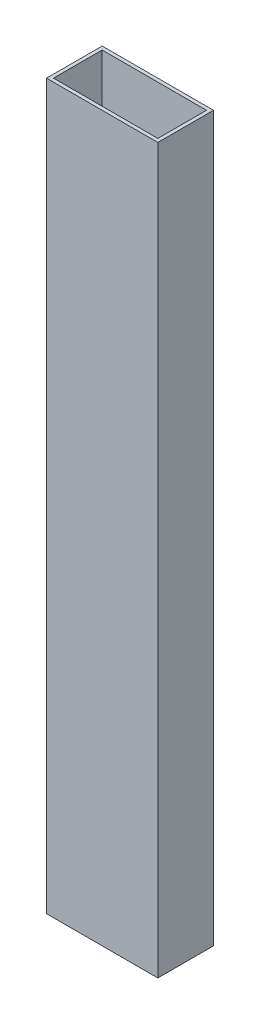
ISO-10303-21;
HEADER;
FILE_DESCRIPTION(('STEP AP214'),'2;1');
FILE_NAME('part.step','',(''),(''),'','','');
FILE_SCHEMA(('AUTOMOTIVE_DESIGN { 1 0 10303 214 1 1 1 1 }'));
ENDSEC;
DATA;
#1=APPLICATION_CONTEXT('core data for automotive mechanical design processes');
#2=APPLICATION_PROTOCOL_DEFINITION('international standard','automotive_design',2000,#1);
#3=PRODUCT_CONTEXT('',#1,'mechanical');
#4=PRODUCT('Part','Part','',(#3));
#5=PRODUCT_RELATED_PRODUCT_CATEGORY('part','',(#4));
#6=PRODUCT_DEFINITION_FORMATION('','',#4);
#7=PRODUCT_DEFINITION_CONTEXT('part definition',#1,'design');
#8=PRODUCT_DEFINITION('design','',#6,#7);
#9=PRODUCT_DEFINITION_SHAPE('','',#8);
#10=(LENGTH_UNIT() NAMED_UNIT(*) SI_UNIT(.MILLI.,.METRE.));
#11=(NAMED_UNIT(*) PLANE_ANGLE_UNIT() SI_UNIT($,.RADIAN.));
#12=(NAMED_UNIT(*) SI_UNIT($,.STERADIAN.) SOLID_ANGLE_UNIT());
#13=UNCERTAINTY_MEASURE_WITH_UNIT(LENGTH_MEASURE(1.E-05),#10,'distance_accuracy_value','');
#14=(GEOMETRIC_REPRESENTATION_CONTEXT(3) GLOBAL_UNCERTAINTY_ASSIGNED_CONTEXT((#13)) GLOBAL_UNIT_ASSIGNED_CONTEXT((#10,
#11,#12)) REPRESENTATION_CONTEXT('',''));
#15=CARTESIAN_POINT('',(0.,0.,0.));
#16=DIRECTION('',(0.,0.,1.));
#17=DIRECTION('',(1.,0.,0.));
#18=AXIS2_PLACEMENT_3D('',#15,#16,#17);
#19=CARTESIAN_POINT('',(0.,330.2,0.));
#20=DIRECTION('',(0.,1.,0.));
#21=DIRECTION('',(0.,0.,1.));
#22=AXIS2_PLACEMENT_3D('',#19,#20,#21);
#23=PLANE('',#22);
#24=DIRECTION('',(0.,0.,1.));
#25=VECTOR('',#24,1.);
#26=CARTESIAN_POINT('',(0.,330.2,0.));
#27=LINE('',#26,#25);
#28=CARTESIAN_POINT('',(0.,330.2,-25.4));
#29=VERTEX_POINT('',#28);
#30=CARTESIAN_POINT('',(0.,330.2,0.));
#31=VERTEX_POINT('',#30);
#32=EDGE_CURVE('E158',#29,#31,#27,.T.);
#33=ORIENTED_EDGE('',*,*,#32,.T.);
#34=DIRECTION('',(1.,0.,0.));
#35=VECTOR('',#34,1.);
#36=CARTESIAN_POINT('',(0.,330.2,0.));
#37=LINE('',#36,#35);
#38=CARTESIAN_POINT('',(50.8,330.2,0.));
#39=VERTEX_POINT('',#38);
#40=EDGE_CURVE('E161',#31,#39,#37,.T.);
#41=ORIENTED_EDGE('',*,*,#40,.T.);
#42=DIRECTION('',(0.,0.,-1.));
#43=VECTOR('',#42,1.);
#44=CARTESIAN_POINT('',(50.8,330.2,0.));
#45=LINE('',#44,#43);
#46=CARTESIAN_POINT('',(50.8,330.2,-25.4));
#47=VERTEX_POINT('',#46);
#48=EDGE_CURVE('E164',#39,#47,#45,.T.);
#49=ORIENTED_EDGE('',*,*,#48,.T.);
#50=DIRECTION('',(-1.,0.,0.));
#51=VECTOR('',#50,1.);
#52=CARTESIAN_POINT('',(0.,330.2,-25.4));
#53=LINE('',#52,#51);
#54=EDGE_CURVE('E166',#47,#29,#53,.T.);
#55=ORIENTED_EDGE('',*,*,#54,.T.);
#56=EDGE_LOOP('',(#33,#41,#49,#55));
#57=FACE_BOUND('',#56,.T.);
#58=DIRECTION('',(1.,0.,0.));
#59=VECTOR('',#58,1.);
#60=CARTESIAN_POINT('',(0.,330.2,-1.5875));
#61=LINE('',#60,#59);
#62=CARTESIAN_POINT('',(1.5875,330.2,-1.5875));
#63=VERTEX_POINT('',#62);
#64=CARTESIAN_POINT('',(49.2125,330.2,-1.5875));
#65=VERTEX_POINT('',#64);
#66=EDGE_CURVE('E130',#63,#65,#61,.T.);
#67=ORIENTED_EDGE('',*,*,#66,.F.);
#68=DIRECTION('',(0.,0.,1.));
#69=VECTOR('',#68,1.);
#70=CARTESIAN_POINT('',(1.5875,330.2,0.));
#71=LINE('',#70,#69);
#72=CARTESIAN_POINT('',(1.58749999999999,330.2,-23.8125));
#73=VERTEX_POINT('',#72);
#74=EDGE_CURVE('E122',#73,#63,#71,.T.);
#75=ORIENTED_EDGE('',*,*,#74,.F.);
#76=DIRECTION('',(-1.,0.,0.));
#77=VECTOR('',#76,1.);
#78=CARTESIAN_POINT('',(0.,330.2,-23.8125));
#79=LINE('',#78,#77);
#80=CARTESIAN_POINT('',(49.2125,330.2,-23.8125));
#81=VERTEX_POINT('',#80);
#82=EDGE_CURVE('E144',#81,#73,#79,.T.);
#83=ORIENTED_EDGE('',*,*,#82,.F.);
#84=DIRECTION('',(0.,0.,-1.));
#85=VECTOR('',#84,1.);
#86=CARTESIAN_POINT('',(49.2125,330.2,0.));
#87=LINE('',#86,#85);
#88=EDGE_CURVE('E142',#65,#81,#87,.T.);
#89=ORIENTED_EDGE('',*,*,#88,.F.);
#90=EDGE_LOOP('',(#67,#75,#83,#89));
#91=FACE_BOUND('',#90,.T.);
#92=ADVANCED_FACE('F57',(#57,#91),#23,.T.);
#93=CARTESIAN_POINT('',(0.,0.,0.));
#94=DIRECTION('',(0.,1.,0.));
#95=DIRECTION('',(0.,0.,1.));
#96=AXIS2_PLACEMENT_3D('',#93,#94,#95);
#97=PLANE('',#96);
#98=DIRECTION('',(0.,0.,1.));
#99=VECTOR('',#98,1.);
#100=CARTESIAN_POINT('',(0.,0.,0.));
#101=LINE('',#100,#99);
#102=CARTESIAN_POINT('',(0.,0.,-25.4));
#103=VERTEX_POINT('',#102);
#104=CARTESIAN_POINT('',(0.,0.,0.));
#105=VERTEX_POINT('',#104);
#106=EDGE_CURVE('E138',#103,#105,#101,.T.);
#107=ORIENTED_EDGE('',*,*,#106,.F.);
#108=DIRECTION('',(-1.,0.,0.));
#109=VECTOR('',#108,1.);
#110=CARTESIAN_POINT('',(0.,0.,-25.4));
#111=LINE('',#110,#109);
#112=CARTESIAN_POINT('',(50.8,0.,-25.4));
#113=VERTEX_POINT('',#112);
#114=EDGE_CURVE('E162',#113,#103,#111,.T.);
#115=ORIENTED_EDGE('',*,*,#114,.F.);
#116=DIRECTION('',(0.,0.,-1.));
#117=VECTOR('',#116,1.);
#118=CARTESIAN_POINT('',(50.8,0.,0.));
#119=LINE('',#118,#117);
#120=CARTESIAN_POINT('',(50.8,0.,0.));
#121=VERTEX_POINT('',#120);
#122=EDGE_CURVE('E173',#121,#113,#119,.T.);
#123=ORIENTED_EDGE('',*,*,#122,.F.);
#124=DIRECTION('',(1.,0.,0.));
#125=VECTOR('',#124,1.);
#126=CARTESIAN_POINT('',(0.,0.,0.));
#127=LINE('',#126,#125);
#128=EDGE_CURVE('E171',#105,#121,#127,.T.);
#129=ORIENTED_EDGE('',*,*,#128,.F.);
#130=EDGE_LOOP('',(#107,#115,#123,#129));
#131=FACE_BOUND('',#130,.T.);
#132=DIRECTION('',(0.,0.,1.));
#133=VECTOR('',#132,1.);
#134=CARTESIAN_POINT('',(1.5875,0.,0.));
#135=LINE('',#134,#133);
#136=CARTESIAN_POINT('',(1.58749999999999,0.,-23.8125));
#137=VERTEX_POINT('',#136);
#138=CARTESIAN_POINT('',(1.5875,0.,-1.5875));
#139=VERTEX_POINT('',#138);
#140=EDGE_CURVE('E80',#137,#139,#135,.T.);
#141=ORIENTED_EDGE('',*,*,#140,.T.);
#142=DIRECTION('',(1.,0.,0.));
#143=VECTOR('',#142,1.);
#144=CARTESIAN_POINT('',(0.,0.,-1.5875));
#145=LINE('',#144,#143);
#146=CARTESIAN_POINT('',(49.2125,0.,-1.5875));
#147=VERTEX_POINT('',#146);
#148=EDGE_CURVE('E137',#139,#147,#145,.T.);
#149=ORIENTED_EDGE('',*,*,#148,.T.);
#150=DIRECTION('',(0.,0.,-1.));
#151=VECTOR('',#150,1.);
#152=CARTESIAN_POINT('',(49.2125,0.,0.));
#153=LINE('',#152,#151);
#154=CARTESIAN_POINT('',(49.2125,0.,-23.8125));
#155=VERTEX_POINT('',#154);
#156=EDGE_CURVE('E150',#147,#155,#153,.T.);
#157=ORIENTED_EDGE('',*,*,#156,.T.);
#158=DIRECTION('',(-1.,0.,0.));
#159=VECTOR('',#158,1.);
#160=CARTESIAN_POINT('',(0.,0.,-23.8125));
#161=LINE('',#160,#159);
#162=EDGE_CURVE('E131',#155,#137,#161,.T.);
#163=ORIENTED_EDGE('',*,*,#162,.T.);
#164=EDGE_LOOP('',(#141,#149,#157,#163));
#165=FACE_BOUND('',#164,.T.);
#166=ADVANCED_FACE('F191',(#131,#165),#97,.F.);
#167=CARTESIAN_POINT('',(0.,330.2,0.));
#168=DIRECTION('',(1.,0.,0.));
#169=DIRECTION('',(0.,0.,-1.));
#170=AXIS2_PLACEMENT_3D('',#167,#168,#169);
#171=PLANE('',#170);
#172=ORIENTED_EDGE('',*,*,#106,.T.);
#173=DIRECTION('',(0.,-1.,0.));
#174=VECTOR('',#173,1.);
#175=CARTESIAN_POINT('',(0.,330.2,0.));
#176=LINE('',#175,#174);
#177=EDGE_CURVE('E12',#31,#105,#176,.T.);
#178=ORIENTED_EDGE('',*,*,#177,.F.);
#179=ORIENTED_EDGE('',*,*,#32,.F.);
#180=DIRECTION('',(0.,-1.,0.));
#181=VECTOR('',#180,1.);
#182=CARTESIAN_POINT('',(0.,330.2,-25.4));
#183=LINE('',#182,#181);
#184=EDGE_CURVE('E168',#29,#103,#183,.T.);
#185=ORIENTED_EDGE('',*,*,#184,.T.);
#186=EDGE_LOOP('',(#172,#178,#179,#185));
#187=FACE_BOUND('',#186,.T.);
#188=ADVANCED_FACE('F59',(#187),#171,.F.);
#189=CARTESIAN_POINT('',(0.,330.2,0.));
#190=DIRECTION('',(0.,0.,-1.));
#191=DIRECTION('',(-1.,0.,0.));
#192=AXIS2_PLACEMENT_3D('',#189,#190,#191);
#193=PLANE('',#192);
#194=ORIENTED_EDGE('',*,*,#128,.T.);
#195=DIRECTION('',(0.,-1.,0.));
#196=VECTOR('',#195,1.);
#197=CARTESIAN_POINT('',(50.8,330.2,0.));
#198=LINE('',#197,#196);
#199=EDGE_CURVE('E65',#39,#121,#198,.T.);
#200=ORIENTED_EDGE('',*,*,#199,.F.);
#201=ORIENTED_EDGE('',*,*,#40,.F.);
#202=ORIENTED_EDGE('',*,*,#177,.T.);
#203=EDGE_LOOP('',(#194,#200,#201,#202));
#204=FACE_BOUND('',#203,.T.);
#205=ADVANCED_FACE('F201',(#204),#193,.F.);
#206=CARTESIAN_POINT('',(50.8,330.2,0.));
#207=DIRECTION('',(-1.,0.,0.));
#208=DIRECTION('',(0.,0.,1.));
#209=AXIS2_PLACEMENT_3D('',#206,#207,#208);
#210=PLANE('',#209);
#211=ORIENTED_EDGE('',*,*,#122,.T.);
#212=DIRECTION('',(0.,-1.,0.));
#213=VECTOR('',#212,1.);
#214=CARTESIAN_POINT('',(50.8,330.2,-25.4));
#215=LINE('',#214,#213);
#216=EDGE_CURVE('E178',#47,#113,#215,.T.);
#217=ORIENTED_EDGE('',*,*,#216,.F.);
#218=ORIENTED_EDGE('',*,*,#48,.F.);
#219=ORIENTED_EDGE('',*,*,#199,.T.);
#220=EDGE_LOOP('',(#211,#217,#218,#219));
#221=FACE_BOUND('',#220,.T.);
#222=ADVANCED_FACE('F185',(#221),#210,.F.);
#223=CARTESIAN_POINT('',(0.,330.2,-25.4));
#224=DIRECTION('',(0.,0.,1.));
#225=DIRECTION('',(1.,0.,0.));
#226=AXIS2_PLACEMENT_3D('',#223,#224,#225);
#227=PLANE('',#226);
#228=ORIENTED_EDGE('',*,*,#114,.T.);
#229=ORIENTED_EDGE('',*,*,#184,.F.);
#230=ORIENTED_EDGE('',*,*,#54,.F.);
#231=ORIENTED_EDGE('',*,*,#216,.T.);
#232=EDGE_LOOP('',(#228,#229,#230,#231));
#233=FACE_BOUND('',#232,.T.);
#234=ADVANCED_FACE('F195',(#233),#227,.F.);
#235=CARTESIAN_POINT('',(1.5875,330.2,0.));
#236=DIRECTION('',(1.,0.,0.));
#237=DIRECTION('',(0.,0.,-1.));
#238=AXIS2_PLACEMENT_3D('',#235,#236,#237);
#239=PLANE('',#238);
#240=ORIENTED_EDGE('',*,*,#140,.F.);
#241=DIRECTION('',(0.,-1.,0.));
#242=VECTOR('',#241,1.);
#243=CARTESIAN_POINT('',(1.58749999999999,330.2,-23.8125));
#244=LINE('',#243,#242);
#245=EDGE_CURVE('E126',#73,#137,#244,.T.);
#246=ORIENTED_EDGE('',*,*,#245,.F.);
#247=ORIENTED_EDGE('',*,*,#74,.T.);
#248=DIRECTION('',(0.,-1.,0.));
#249=VECTOR('',#248,1.);
#250=CARTESIAN_POINT('',(1.5875,330.2,-1.5875));
#251=LINE('',#250,#249);
#252=EDGE_CURVE('E125',#63,#139,#251,.T.);
#253=ORIENTED_EDGE('',*,*,#252,.T.);
#254=EDGE_LOOP('',(#240,#246,#247,#253));
#255=FACE_BOUND('',#254,.T.);
#256=ADVANCED_FACE('F124',(#255),#239,.T.);
#257=CARTESIAN_POINT('',(0.,330.2,-1.5875));
#258=DIRECTION('',(0.,0.,-1.));
#259=DIRECTION('',(-1.,0.,0.));
#260=AXIS2_PLACEMENT_3D('',#257,#258,#259);
#261=PLANE('',#260);
#262=ORIENTED_EDGE('',*,*,#148,.F.);
#263=ORIENTED_EDGE('',*,*,#252,.F.);
#264=ORIENTED_EDGE('',*,*,#66,.T.);
#265=DIRECTION('',(0.,-1.,0.));
#266=VECTOR('',#265,1.);
#267=CARTESIAN_POINT('',(49.2125,330.2,-1.5875));
#268=LINE('',#267,#266);
#269=EDGE_CURVE('E139',#65,#147,#268,.T.);
#270=ORIENTED_EDGE('',*,*,#269,.T.);
#271=EDGE_LOOP('',(#262,#263,#264,#270));
#272=FACE_BOUND('',#271,.T.);
#273=ADVANCED_FACE('F134',(#272),#261,.T.);
#274=CARTESIAN_POINT('',(49.2125,330.2,0.));
#275=DIRECTION('',(-1.,0.,0.));
#276=DIRECTION('',(0.,0.,1.));
#277=AXIS2_PLACEMENT_3D('',#274,#275,#276);
#278=PLANE('',#277);
#279=ORIENTED_EDGE('',*,*,#156,.F.);
#280=ORIENTED_EDGE('',*,*,#269,.F.);
#281=ORIENTED_EDGE('',*,*,#88,.T.);
#282=DIRECTION('',(0.,-1.,0.));
#283=VECTOR('',#282,1.);
#284=CARTESIAN_POINT('',(49.2125,330.2,-23.8125));
#285=LINE('',#284,#283);
#286=EDGE_CURVE('E72',#81,#155,#285,.T.);
#287=ORIENTED_EDGE('',*,*,#286,.T.);
#288=EDGE_LOOP('',(#279,#280,#281,#287));
#289=FACE_BOUND('',#288,.T.);
#290=ADVANCED_FACE('F224',(#289),#278,.T.);
#291=CARTESIAN_POINT('',(0.,330.2,-23.8125));
#292=DIRECTION('',(0.,0.,1.));
#293=DIRECTION('',(1.,0.,0.));
#294=AXIS2_PLACEMENT_3D('',#291,#292,#293);
#295=PLANE('',#294);
#296=ORIENTED_EDGE('',*,*,#162,.F.);
#297=ORIENTED_EDGE('',*,*,#286,.F.);
#298=ORIENTED_EDGE('',*,*,#82,.T.);
#299=ORIENTED_EDGE('',*,*,#245,.T.);
#300=EDGE_LOOP('',(#296,#297,#298,#299));
#301=FACE_BOUND('',#300,.T.);
#302=ADVANCED_FACE('F228',(#301),#295,.T.);
#303=CLOSED_SHELL('',(#92,#166,#188,#205,#222,#234,#256,#273,#290,#302));
#304=MANIFOLD_SOLID_BREP('B2',#303);
#305=ADVANCED_BREP_SHAPE_REPRESENTATION('',(#18,#304),#14);
#306=SHAPE_DEFINITION_REPRESENTATION(#9,#305);
ENDSEC;
END-ISO-10303-21;
